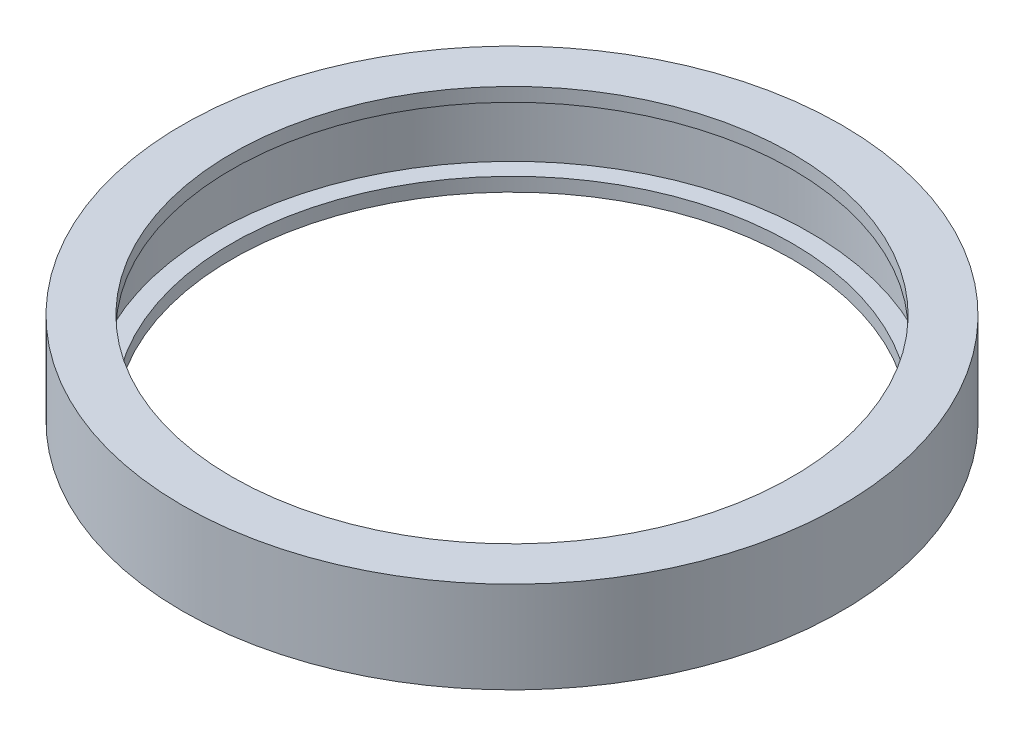
ISO-10303-21;
HEADER;
FILE_DESCRIPTION(('STEP AP214'),'2;1');
FILE_NAME('part.step','',(''),(''),'','','');
FILE_SCHEMA(('AUTOMOTIVE_DESIGN { 1 0 10303 214 1 1 1 1 }'));
ENDSEC;
DATA;
#1=APPLICATION_CONTEXT('core data for automotive mechanical design processes');
#2=APPLICATION_PROTOCOL_DEFINITION('international standard','automotive_design',2000,#1);
#3=PRODUCT_CONTEXT('',#1,'mechanical');
#4=PRODUCT('Part','Part','',(#3));
#5=PRODUCT_RELATED_PRODUCT_CATEGORY('part','',(#4));
#6=PRODUCT_DEFINITION_FORMATION('','',#4);
#7=PRODUCT_DEFINITION_CONTEXT('part definition',#1,'design');
#8=PRODUCT_DEFINITION('design','',#6,#7);
#9=PRODUCT_DEFINITION_SHAPE('','',#8);
#10=(LENGTH_UNIT() NAMED_UNIT(*) SI_UNIT(.MILLI.,.METRE.));
#11=(NAMED_UNIT(*) PLANE_ANGLE_UNIT() SI_UNIT($,.RADIAN.));
#12=(NAMED_UNIT(*) SI_UNIT($,.STERADIAN.) SOLID_ANGLE_UNIT());
#13=UNCERTAINTY_MEASURE_WITH_UNIT(LENGTH_MEASURE(1.E-05),#10,'distance_accuracy_value','');
#14=(GEOMETRIC_REPRESENTATION_CONTEXT(3) GLOBAL_UNCERTAINTY_ASSIGNED_CONTEXT((#13)) GLOBAL_UNIT_ASSIGNED_CONTEXT((#10,
#11,#12)) REPRESENTATION_CONTEXT('',''));
#15=CARTESIAN_POINT('',(0.,0.,0.));
#16=DIRECTION('',(0.,0.,1.));
#17=DIRECTION('',(1.,0.,0.));
#18=AXIS2_PLACEMENT_3D('',#15,#16,#17);
#19=CARTESIAN_POINT('',(0.,5.,0.));
#20=DIRECTION('',(0.,-1.,0.));
#21=DIRECTION('',(0.,0.,-1.));
#22=AXIS2_PLACEMENT_3D('',#19,#20,#21);
#23=CYLINDRICAL_SURFACE('',#22,30.6);
#24=CARTESIAN_POINT('',(0.,-5.,0.));
#25=DIRECTION('',(0.,1.,0.));
#26=DIRECTION('',(0.,0.,1.));
#27=AXIS2_PLACEMENT_3D('',#24,#25,#26);
#28=CIRCLE('',#27,30.6);
#29=CARTESIAN_POINT('',(0.,-5.,30.6));
#30=VERTEX_POINT('',#29);
#31=EDGE_CURVE('E47',#30,#30,#28,.T.);
#32=ORIENTED_EDGE('',*,*,#31,.F.);
#33=EDGE_LOOP('',(#32));
#34=FACE_BOUND('',#33,.T.);
#35=CARTESIAN_POINT('',(0.,-3.5,0.));
#36=DIRECTION('',(0.,1.,0.));
#37=DIRECTION('',(0.,0.,1.));
#38=AXIS2_PLACEMENT_3D('',#35,#36,#37);
#39=CIRCLE('',#38,30.6);
#40=CARTESIAN_POINT('',(0.,-3.5,30.6));
#41=VERTEX_POINT('',#40);
#42=EDGE_CURVE('E35',#41,#41,#39,.T.);
#43=ORIENTED_EDGE('',*,*,#42,.T.);
#44=EDGE_LOOP('',(#43));
#45=FACE_BOUND('',#44,.T.);
#46=ADVANCED_FACE('F31',(#34,#45),#23,.F.);
#47=CARTESIAN_POINT('',(0.,5.,0.));
#48=DIRECTION('',(0.,1.,0.));
#49=DIRECTION('',(0.,0.,1.));
#50=AXIS2_PLACEMENT_3D('',#47,#48,#49);
#51=PLANE('',#50);
#52=CARTESIAN_POINT('',(0.,5.,0.));
#53=DIRECTION('',(0.,1.,0.));
#54=DIRECTION('',(0.,0.,1.));
#55=AXIS2_PLACEMENT_3D('',#52,#53,#54);
#56=CIRCLE('',#55,36.);
#57=CARTESIAN_POINT('',(0.,5.,36.));
#58=VERTEX_POINT('',#57);
#59=EDGE_CURVE('E10',#58,#58,#56,.T.);
#60=ORIENTED_EDGE('',*,*,#59,.T.);
#61=EDGE_LOOP('',(#60));
#62=FACE_BOUND('',#61,.T.);
#63=CARTESIAN_POINT('',(0.,5.,0.));
#64=DIRECTION('',(0.,1.,0.));
#65=DIRECTION('',(0.,0.,1.));
#66=AXIS2_PLACEMENT_3D('',#63,#64,#65);
#67=CIRCLE('',#66,30.6);
#68=CARTESIAN_POINT('',(0.,5.,30.6));
#69=VERTEX_POINT('',#68);
#70=EDGE_CURVE('E44',#69,#69,#67,.T.);
#71=ORIENTED_EDGE('',*,*,#70,.F.);
#72=EDGE_LOOP('',(#71));
#73=FACE_BOUND('',#72,.T.);
#74=ADVANCED_FACE('F72',(#62,#73),#51,.T.);
#75=CARTESIAN_POINT('',(0.,-5.,0.));
#76=DIRECTION('',(0.,1.,0.));
#77=DIRECTION('',(0.,0.,1.));
#78=AXIS2_PLACEMENT_3D('',#75,#76,#77);
#79=PLANE('',#78);
#80=CARTESIAN_POINT('',(0.,-5.,0.));
#81=DIRECTION('',(0.,1.,0.));
#82=DIRECTION('',(0.,0.,1.));
#83=AXIS2_PLACEMENT_3D('',#80,#81,#82);
#84=CIRCLE('',#83,36.);
#85=CARTESIAN_POINT('',(0.,-5.,36.));
#86=VERTEX_POINT('',#85);
#87=EDGE_CURVE('E39',#86,#86,#84,.T.);
#88=ORIENTED_EDGE('',*,*,#87,.F.);
#89=EDGE_LOOP('',(#88));
#90=FACE_BOUND('',#89,.T.);
#91=ORIENTED_EDGE('',*,*,#31,.T.);
#92=EDGE_LOOP('',(#91));
#93=FACE_BOUND('',#92,.T.);
#94=ADVANCED_FACE('F68',(#90,#93),#79,.F.);
#95=CARTESIAN_POINT('',(0.,5.,0.));
#96=DIRECTION('',(0.,-1.,0.));
#97=DIRECTION('',(0.,0.,-1.));
#98=AXIS2_PLACEMENT_3D('',#95,#96,#97);
#99=CYLINDRICAL_SURFACE('',#98,36.);
#100=ORIENTED_EDGE('',*,*,#59,.F.);
#101=EDGE_LOOP('',(#100));
#102=FACE_BOUND('',#101,.T.);
#103=ORIENTED_EDGE('',*,*,#87,.T.);
#104=EDGE_LOOP('',(#103));
#105=FACE_BOUND('',#104,.T.);
#106=ADVANCED_FACE('F33',(#102,#105),#99,.T.);
#107=CARTESIAN_POINT('',(0.,3.5,0.));
#108=DIRECTION('',(0.,1.,0.));
#109=DIRECTION('',(0.,0.,1.));
#110=AXIS2_PLACEMENT_3D('',#107,#108,#109);
#111=CIRCLE('',#110,30.6);
#112=CARTESIAN_POINT('',(0.,3.5,30.6));
#113=VERTEX_POINT('',#112);
#114=EDGE_CURVE('E49',#113,#113,#111,.T.);
#115=ORIENTED_EDGE('',*,*,#114,.F.);
#116=EDGE_LOOP('',(#115));
#117=FACE_BOUND('',#116,.T.);
#118=ORIENTED_EDGE('',*,*,#70,.T.);
#119=EDGE_LOOP('',(#118));
#120=FACE_BOUND('',#119,.T.);
#121=ADVANCED_FACE('F74',(#117,#120),#23,.F.);
#122=CARTESIAN_POINT('',(0.,-3.5,0.));
#123=DIRECTION('',(0.,1.,0.));
#124=DIRECTION('',(0.,0.,1.));
#125=AXIS2_PLACEMENT_3D('',#122,#123,#124);
#126=CYLINDRICAL_SURFACE('',#125,32.6);
#127=CARTESIAN_POINT('',(0.,-3.5,0.));
#128=DIRECTION('',(0.,1.,0.));
#129=DIRECTION('',(0.,0.,1.));
#130=AXIS2_PLACEMENT_3D('',#127,#128,#129);
#131=CIRCLE('',#130,32.6);
#132=CARTESIAN_POINT('',(0.,-3.5,32.6));
#133=VERTEX_POINT('',#132);
#134=EDGE_CURVE('E51',#133,#133,#131,.T.);
#135=ORIENTED_EDGE('',*,*,#134,.F.);
#136=EDGE_LOOP('',(#135));
#137=FACE_BOUND('',#136,.T.);
#138=CARTESIAN_POINT('',(0.,3.5,0.));
#139=DIRECTION('',(0.,1.,0.));
#140=DIRECTION('',(0.,0.,1.));
#141=AXIS2_PLACEMENT_3D('',#138,#139,#140);
#142=CIRCLE('',#141,32.6);
#143=CARTESIAN_POINT('',(0.,3.5,32.6));
#144=VERTEX_POINT('',#143);
#145=EDGE_CURVE('E56',#144,#144,#142,.T.);
#146=ORIENTED_EDGE('',*,*,#145,.T.);
#147=EDGE_LOOP('',(#146));
#148=FACE_BOUND('',#147,.T.);
#149=ADVANCED_FACE('F80',(#137,#148),#126,.F.);
#150=CARTESIAN_POINT('',(0.,-3.5,0.));
#151=DIRECTION('',(0.,1.,0.));
#152=DIRECTION('',(0.,0.,1.));
#153=AXIS2_PLACEMENT_3D('',#150,#151,#152);
#154=PLANE('',#153);
#155=ORIENTED_EDGE('',*,*,#42,.F.);
#156=EDGE_LOOP('',(#155));
#157=FACE_BOUND('',#156,.T.);
#158=ORIENTED_EDGE('',*,*,#134,.T.);
#159=EDGE_LOOP('',(#158));
#160=FACE_BOUND('',#159,.T.);
#161=ADVANCED_FACE('F77',(#157,#160),#154,.T.);
#162=CARTESIAN_POINT('',(0.,3.5,0.));
#163=DIRECTION('',(0.,1.,0.));
#164=DIRECTION('',(0.,0.,1.));
#165=AXIS2_PLACEMENT_3D('',#162,#163,#164);
#166=PLANE('',#165);
#167=ORIENTED_EDGE('',*,*,#114,.T.);
#168=EDGE_LOOP('',(#167));
#169=FACE_BOUND('',#168,.T.);
#170=ORIENTED_EDGE('',*,*,#145,.F.);
#171=EDGE_LOOP('',(#170));
#172=FACE_BOUND('',#171,.T.);
#173=ADVANCED_FACE('F79',(#169,#172),#166,.F.);
#174=CLOSED_SHELL('',(#46,#74,#94,#106,#121,#149,#161,#173));
#175=MANIFOLD_SOLID_BREP('B2',#174);
#176=ADVANCED_BREP_SHAPE_REPRESENTATION('',(#18,#175),#14);
#177=SHAPE_DEFINITION_REPRESENTATION(#9,#176);
ENDSEC;
END-ISO-10303-21;
